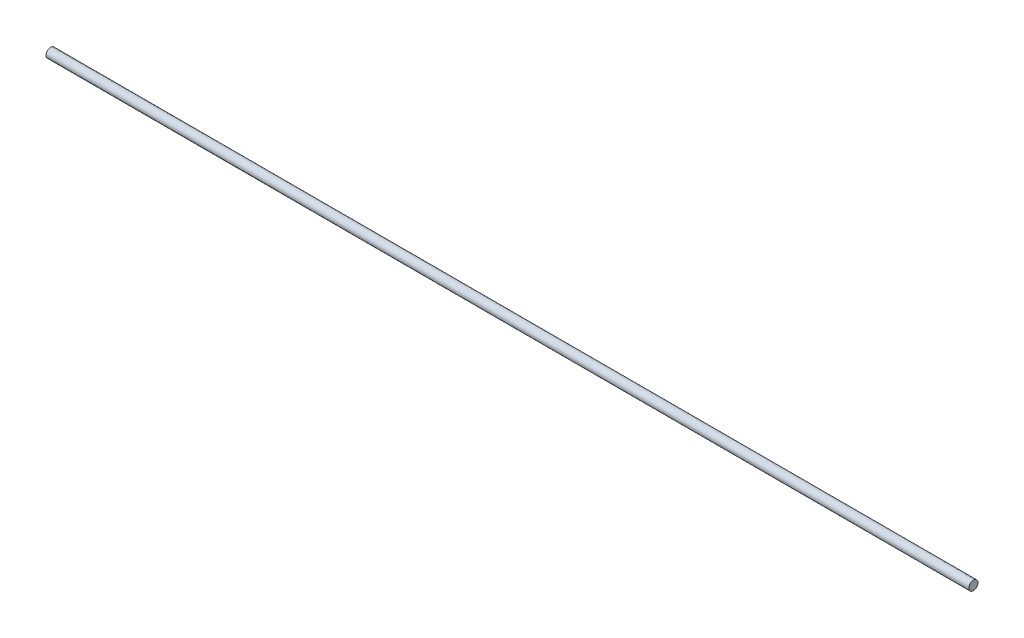
ISO-10303-21;
HEADER;
FILE_DESCRIPTION(('STEP AP214'),'2;1');
FILE_NAME('part.step','',(''),(''),'','','');
FILE_SCHEMA(('AUTOMOTIVE_DESIGN { 1 0 10303 214 1 1 1 1 }'));
ENDSEC;
DATA;
#1=APPLICATION_CONTEXT('core data for automotive mechanical design processes');
#2=APPLICATION_PROTOCOL_DEFINITION('international standard','automotive_design',2000,#1);
#3=PRODUCT_CONTEXT('',#1,'mechanical');
#4=PRODUCT('Part','Part','',(#3));
#5=PRODUCT_RELATED_PRODUCT_CATEGORY('part','',(#4));
#6=PRODUCT_DEFINITION_FORMATION('','',#4);
#7=PRODUCT_DEFINITION_CONTEXT('part definition',#1,'design');
#8=PRODUCT_DEFINITION('design','',#6,#7);
#9=PRODUCT_DEFINITION_SHAPE('','',#8);
#10=(LENGTH_UNIT() NAMED_UNIT(*) SI_UNIT(.MILLI.,.METRE.));
#11=(NAMED_UNIT(*) PLANE_ANGLE_UNIT() SI_UNIT($,.RADIAN.));
#12=(NAMED_UNIT(*) SI_UNIT($,.STERADIAN.) SOLID_ANGLE_UNIT());
#13=UNCERTAINTY_MEASURE_WITH_UNIT(LENGTH_MEASURE(1.E-05),#10,'distance_accuracy_value','');
#14=(GEOMETRIC_REPRESENTATION_CONTEXT(3) GLOBAL_UNCERTAINTY_ASSIGNED_CONTEXT((#13)) GLOBAL_UNIT_ASSIGNED_CONTEXT((#10,
#11,#12)) REPRESENTATION_CONTEXT('',''));
#15=CARTESIAN_POINT('',(0.,0.,0.));
#16=DIRECTION('',(0.,0.,1.));
#17=DIRECTION('',(1.,0.,0.));
#18=AXIS2_PLACEMENT_3D('',#15,#16,#17);
#19=CARTESIAN_POINT('',(300.,0.,0.));
#20=DIRECTION('',(-1.,0.,0.));
#21=DIRECTION('',(0.,0.,1.));
#22=AXIS2_PLACEMENT_3D('',#19,#20,#21);
#23=CYLINDRICAL_SURFACE('',#22,1.5);
#24=CARTESIAN_POINT('',(300.,0.,0.));
#25=DIRECTION('',(1.,0.,0.));
#26=DIRECTION('',(0.,0.,-1.));
#27=AXIS2_PLACEMENT_3D('',#24,#25,#26);
#28=CIRCLE('',#27,1.5);
#29=CARTESIAN_POINT('',(300.,0.,-1.5));
#30=VERTEX_POINT('',#29);
#31=EDGE_CURVE('E10',#30,#30,#28,.T.);
#32=ORIENTED_EDGE('',*,*,#31,.F.);
#33=EDGE_LOOP('',(#32));
#34=FACE_BOUND('',#33,.T.);
#35=CARTESIAN_POINT('',(0.,0.,0.));
#36=DIRECTION('',(1.,0.,0.));
#37=DIRECTION('',(0.,0.,-1.));
#38=AXIS2_PLACEMENT_3D('',#35,#36,#37);
#39=CIRCLE('',#38,1.5);
#40=CARTESIAN_POINT('',(0.,0.,-1.5));
#41=VERTEX_POINT('',#40);
#42=EDGE_CURVE('E38',#41,#41,#39,.T.);
#43=ORIENTED_EDGE('',*,*,#42,.T.);
#44=EDGE_LOOP('',(#43));
#45=FACE_BOUND('',#44,.T.);
#46=ADVANCED_FACE('F35',(#34,#45),#23,.T.);
#47=CARTESIAN_POINT('',(300.,0.,0.));
#48=DIRECTION('',(1.,0.,0.));
#49=DIRECTION('',(0.,0.,-1.));
#50=AXIS2_PLACEMENT_3D('',#47,#48,#49);
#51=PLANE('',#50);
#52=ORIENTED_EDGE('',*,*,#31,.T.);
#53=EDGE_LOOP('',(#52));
#54=FACE_BOUND('',#53,.T.);
#55=ADVANCED_FACE('F50',(#54),#51,.T.);
#56=CARTESIAN_POINT('',(0.,0.,0.));
#57=DIRECTION('',(1.,0.,0.));
#58=DIRECTION('',(0.,0.,-1.));
#59=AXIS2_PLACEMENT_3D('',#56,#57,#58);
#60=PLANE('',#59);
#61=ORIENTED_EDGE('',*,*,#42,.F.);
#62=EDGE_LOOP('',(#61));
#63=FACE_BOUND('',#62,.T.);
#64=ADVANCED_FACE('F48',(#63),#60,.F.);
#65=CLOSED_SHELL('',(#46,#55,#64));
#66=MANIFOLD_SOLID_BREP('B2',#65);
#67=ADVANCED_BREP_SHAPE_REPRESENTATION('',(#18,#66),#14);
#68=SHAPE_DEFINITION_REPRESENTATION(#9,#67);
ENDSEC;
END-ISO-10303-21;
